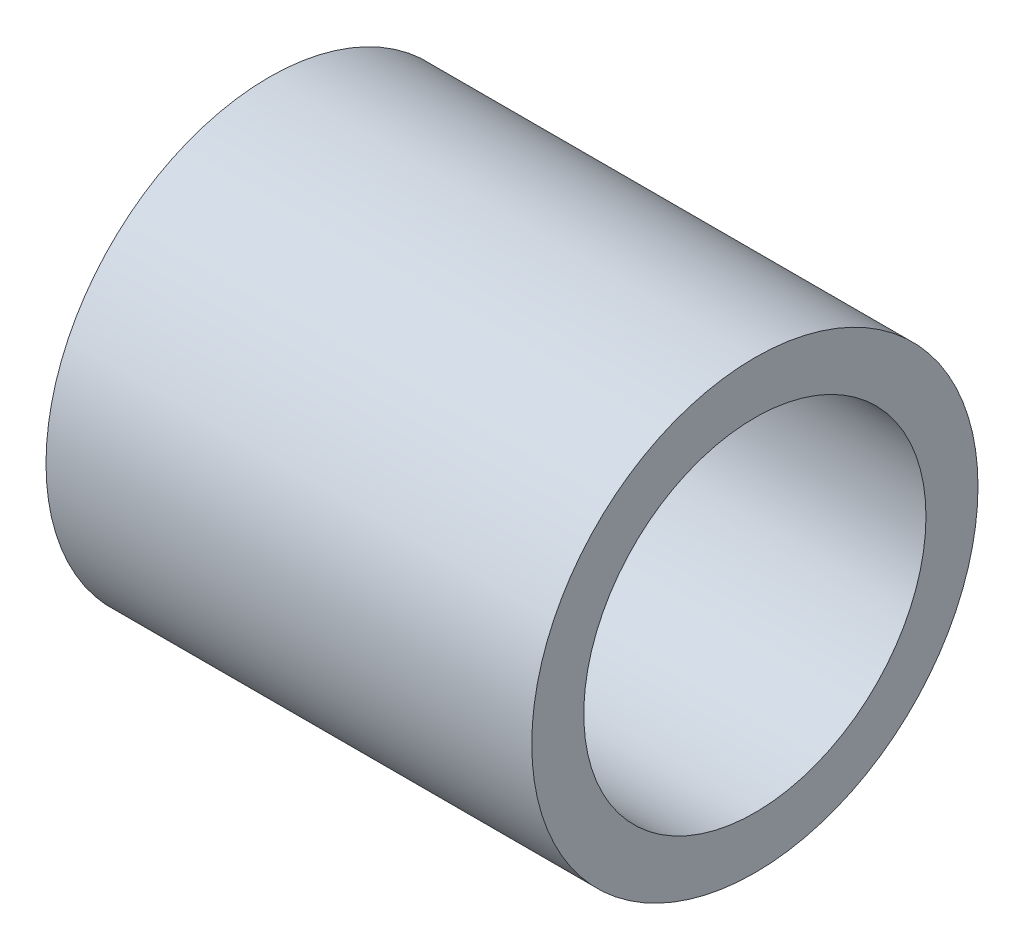
ISO-10303-21;
HEADER;
FILE_DESCRIPTION(('STEP AP214'),'2;1');
FILE_NAME('part.step','',(''),(''),'','','');
FILE_SCHEMA(('AUTOMOTIVE_DESIGN { 1 0 10303 214 1 1 1 1 }'));
ENDSEC;
DATA;
#1=APPLICATION_CONTEXT('core data for automotive mechanical design processes');
#2=APPLICATION_PROTOCOL_DEFINITION('international standard','automotive_design',2000,#1);
#3=PRODUCT_CONTEXT('',#1,'mechanical');
#4=PRODUCT('Part','Part','',(#3));
#5=PRODUCT_RELATED_PRODUCT_CATEGORY('part','',(#4));
#6=PRODUCT_DEFINITION_FORMATION('','',#4);
#7=PRODUCT_DEFINITION_CONTEXT('part definition',#1,'design');
#8=PRODUCT_DEFINITION('design','',#6,#7);
#9=PRODUCT_DEFINITION_SHAPE('','',#8);
#10=(LENGTH_UNIT() NAMED_UNIT(*) SI_UNIT(.MILLI.,.METRE.));
#11=(NAMED_UNIT(*) PLANE_ANGLE_UNIT() SI_UNIT($,.RADIAN.));
#12=(NAMED_UNIT(*) SI_UNIT($,.STERADIAN.) SOLID_ANGLE_UNIT());
#13=UNCERTAINTY_MEASURE_WITH_UNIT(LENGTH_MEASURE(1.E-05),#10,'distance_accuracy_value','');
#14=(GEOMETRIC_REPRESENTATION_CONTEXT(3) GLOBAL_UNCERTAINTY_ASSIGNED_CONTEXT((#13)) GLOBAL_UNIT_ASSIGNED_CONTEXT((#10,
#11,#12)) REPRESENTATION_CONTEXT('',''));
#15=CARTESIAN_POINT('',(0.,0.,0.));
#16=DIRECTION('',(0.,0.,1.));
#17=DIRECTION('',(1.,0.,0.));
#18=AXIS2_PLACEMENT_3D('',#15,#16,#17);
#19=CARTESIAN_POINT('',(0.,0.,0.));
#20=DIRECTION('',(1.,0.,0.));
#21=DIRECTION('',(0.,0.,-1.));
#22=AXIS2_PLACEMENT_3D('',#19,#20,#21);
#23=CYLINDRICAL_SURFACE('',#22,15.1455);
#24=CARTESIAN_POINT('',(0.,0.,0.));
#25=DIRECTION('',(1.,0.,0.));
#26=DIRECTION('',(0.,0.,-1.));
#27=AXIS2_PLACEMENT_3D('',#24,#25,#26);
#28=CIRCLE('',#27,15.1455);
#29=CARTESIAN_POINT('',(0.,0.,-15.1455));
#30=VERTEX_POINT('',#29);
#31=EDGE_CURVE('E27',#30,#30,#28,.T.);
#32=ORIENTED_EDGE('',*,*,#31,.F.);
#33=EDGE_LOOP('',(#32));
#34=FACE_BOUND('',#33,.T.);
#35=CARTESIAN_POINT('',(43.,0.,0.));
#36=DIRECTION('',(1.,0.,0.));
#37=DIRECTION('',(0.,0.,-1.));
#38=AXIS2_PLACEMENT_3D('',#35,#36,#37);
#39=CIRCLE('',#38,15.1455);
#40=CARTESIAN_POINT('',(43.,0.,-15.1455));
#41=VERTEX_POINT('',#40);
#42=EDGE_CURVE('E18',#41,#41,#39,.F.);
#43=ORIENTED_EDGE('',*,*,#42,.F.);
#44=EDGE_LOOP('',(#43));
#45=FACE_BOUND('',#44,.T.);
#46=ADVANCED_FACE('F15',(#34,#45),#23,.F.);
#47=CARTESIAN_POINT('',(43.,17.44775,0.));
#48=DIRECTION('',(1.,0.,0.));
#49=DIRECTION('',(0.,0.,-1.));
#50=AXIS2_PLACEMENT_3D('',#47,#48,#49);
#51=PLANE('',#50);
#52=ORIENTED_EDGE('',*,*,#42,.T.);
#53=EDGE_LOOP('',(#52));
#54=FACE_BOUND('',#53,.T.);
#55=CARTESIAN_POINT('',(43.,0.,0.));
#56=DIRECTION('',(1.,0.,0.));
#57=DIRECTION('',(0.,1.,0.));
#58=AXIS2_PLACEMENT_3D('',#55,#56,#57);
#59=CIRCLE('',#58,19.75);
#60=CARTESIAN_POINT('',(43.,19.75,0.));
#61=VERTEX_POINT('',#60);
#62=EDGE_CURVE('E22',#61,#61,#59,.F.);
#63=ORIENTED_EDGE('',*,*,#62,.F.);
#64=EDGE_LOOP('',(#63));
#65=FACE_BOUND('',#64,.T.);
#66=ADVANCED_FACE('F35',(#54,#65),#51,.T.);
#67=CARTESIAN_POINT('',(0.,17.44775,0.));
#68=DIRECTION('',(-1.,0.,0.));
#69=DIRECTION('',(0.,0.,1.));
#70=AXIS2_PLACEMENT_3D('',#67,#68,#69);
#71=PLANE('',#70);
#72=ORIENTED_EDGE('',*,*,#31,.T.);
#73=EDGE_LOOP('',(#72));
#74=FACE_BOUND('',#73,.T.);
#75=CARTESIAN_POINT('',(0.,0.,0.));
#76=DIRECTION('',(1.,0.,0.));
#77=DIRECTION('',(0.,1.,0.));
#78=AXIS2_PLACEMENT_3D('',#75,#76,#77);
#79=CIRCLE('',#78,19.75);
#80=CARTESIAN_POINT('',(0.,19.75,0.));
#81=VERTEX_POINT('',#80);
#82=EDGE_CURVE('E10',#81,#81,#79,.T.);
#83=ORIENTED_EDGE('',*,*,#82,.F.);
#84=EDGE_LOOP('',(#83));
#85=FACE_BOUND('',#84,.T.);
#86=ADVANCED_FACE('F44',(#74,#85),#71,.T.);
#87=CARTESIAN_POINT('',(0.,0.,0.));
#88=DIRECTION('',(1.,0.,0.));
#89=DIRECTION('',(0.,1.,0.));
#90=AXIS2_PLACEMENT_3D('',#87,#88,#89);
#91=CYLINDRICAL_SURFACE('',#90,19.75);
#92=ORIENTED_EDGE('',*,*,#62,.T.);
#93=EDGE_LOOP('',(#92));
#94=FACE_BOUND('',#93,.T.);
#95=ORIENTED_EDGE('',*,*,#82,.T.);
#96=EDGE_LOOP('',(#95));
#97=FACE_BOUND('',#96,.T.);
#98=ADVANCED_FACE('F45',(#94,#97),#91,.T.);
#99=CLOSED_SHELL('',(#46,#66,#86,#98));
#100=MANIFOLD_SOLID_BREP('B1',#99);
#101=ADVANCED_BREP_SHAPE_REPRESENTATION('',(#18,#100),#14);
#102=SHAPE_DEFINITION_REPRESENTATION(#9,#101);
ENDSEC;
END-ISO-10303-21;
